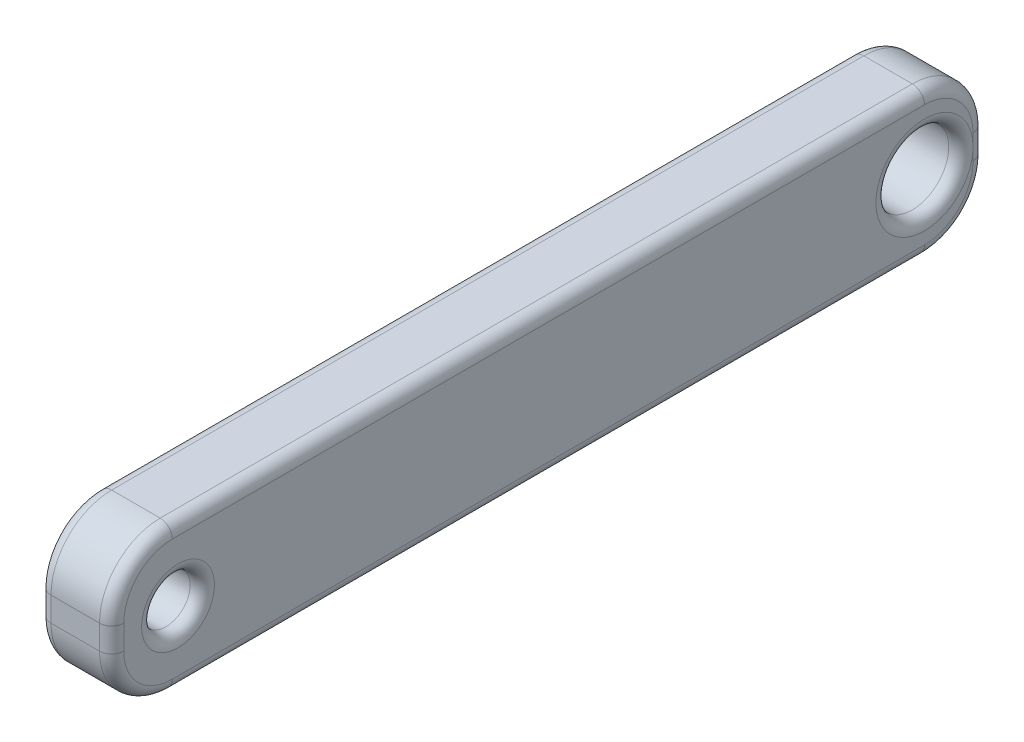
ISO-10303-21;
HEADER;
FILE_DESCRIPTION(('STEP AP214'),'2;1');
FILE_NAME('part.step','',(''),(''),'','','');
FILE_SCHEMA(('AUTOMOTIVE_DESIGN { 1 0 10303 214 1 1 1 1 }'));
ENDSEC;
DATA;
#1=APPLICATION_CONTEXT('core data for automotive mechanical design processes');
#2=APPLICATION_PROTOCOL_DEFINITION('international standard','automotive_design',2000,#1);
#3=PRODUCT_CONTEXT('',#1,'mechanical');
#4=PRODUCT('Part','Part','',(#3));
#5=PRODUCT_RELATED_PRODUCT_CATEGORY('part','',(#4));
#6=PRODUCT_DEFINITION_FORMATION('','',#4);
#7=PRODUCT_DEFINITION_CONTEXT('part definition',#1,'design');
#8=PRODUCT_DEFINITION('design','',#6,#7);
#9=PRODUCT_DEFINITION_SHAPE('','',#8);
#10=(LENGTH_UNIT() NAMED_UNIT(*) SI_UNIT(.MILLI.,.METRE.));
#11=(NAMED_UNIT(*) PLANE_ANGLE_UNIT() SI_UNIT($,.RADIAN.));
#12=(NAMED_UNIT(*) SI_UNIT($,.STERADIAN.) SOLID_ANGLE_UNIT());
#13=UNCERTAINTY_MEASURE_WITH_UNIT(LENGTH_MEASURE(1.E-05),#10,'distance_accuracy_value','');
#14=(GEOMETRIC_REPRESENTATION_CONTEXT(3) GLOBAL_UNCERTAINTY_ASSIGNED_CONTEXT((#13)) GLOBAL_UNIT_ASSIGNED_CONTEXT((#10,
#11,#12)) REPRESENTATION_CONTEXT('',''));
#15=CARTESIAN_POINT('',(0.,0.,0.));
#16=DIRECTION('',(0.,0.,1.));
#17=DIRECTION('',(1.,0.,0.));
#18=AXIS2_PLACEMENT_3D('',#15,#16,#17);
#19=CARTESIAN_POINT('',(3.,3.5,-33.5));
#20=DIRECTION('',(1.,0.,0.));
#21=DIRECTION('',(0.,0.,-1.));
#22=AXIS2_PLACEMENT_3D('',#19,#20,#21);
#23=PLANE('',#22);
#24=CARTESIAN_POINT('',(3.,3.,-2.73587532026645));
#25=DIRECTION('',(1.,0.,0.));
#26=DIRECTION('',(0.,0.,-1.));
#27=AXIS2_PLACEMENT_3D('',#24,#25,#26);
#28=CIRCLE('',#27,1.5);
#29=CARTESIAN_POINT('',(3.,3.,-4.23587532026645));
#30=VERTEX_POINT('',#29);
#31=EDGE_CURVE('E11',#30,#30,#28,.F.);
#32=ORIENTED_EDGE('',*,*,#31,.T.);
#33=EDGE_LOOP('',(#32));
#34=FACE_BOUND('',#33,.T.);
#35=CARTESIAN_POINT('',(3.,2.5,-33.5));
#36=DIRECTION('',(1.,0.,0.));
#37=DIRECTION('',(0.,0.,-1.));
#38=AXIS2_PLACEMENT_3D('',#35,#36,#37);
#39=CIRCLE('',#38,2.);
#40=CARTESIAN_POINT('',(3.,0.5,-33.5));
#41=VERTEX_POINT('',#40);
#42=CARTESIAN_POINT('',(3.,2.5,-35.5));
#43=VERTEX_POINT('',#42);
#44=EDGE_CURVE('E50',#41,#43,#39,.T.);
#45=ORIENTED_EDGE('',*,*,#44,.T.);
#46=DIRECTION('',(0.,1.,0.));
#47=VECTOR('',#46,1.);
#48=CARTESIAN_POINT('',(3.,3.5,-35.5));
#49=LINE('',#48,#47);
#50=CARTESIAN_POINT('',(3.,3.00000000000001,-35.5));
#51=VERTEX_POINT('',#50);
#52=EDGE_CURVE('E42',#43,#51,#49,.T.);
#53=ORIENTED_EDGE('',*,*,#52,.T.);
#54=CARTESIAN_POINT('',(3.,3.,-33.5));
#55=DIRECTION('',(1.,0.,0.));
#56=DIRECTION('',(0.,0.,-1.));
#57=AXIS2_PLACEMENT_3D('',#54,#55,#56);
#58=CIRCLE('',#57,2.);
#59=EDGE_CURVE('E248',#51,#51,#58,.F.);
#60=ORIENTED_EDGE('',*,*,#59,.T.);
#61=DIRECTION('',(0.,1.,0.));
#62=VECTOR('',#61,1.);
#63=CARTESIAN_POINT('',(3.,3.5,-35.5));
#64=LINE('',#63,#62);
#65=CARTESIAN_POINT('',(3.,3.5,-35.5));
#66=VERTEX_POINT('',#65);
#67=EDGE_CURVE('E251',#51,#66,#64,.T.);
#68=ORIENTED_EDGE('',*,*,#67,.T.);
#69=CARTESIAN_POINT('',(3.,3.5,-33.5));
#70=DIRECTION('',(1.,0.,0.));
#71=DIRECTION('',(0.,0.,-1.));
#72=AXIS2_PLACEMENT_3D('',#69,#70,#71);
#73=CIRCLE('',#72,2.);
#74=CARTESIAN_POINT('',(3.,5.5,-33.5));
#75=VERTEX_POINT('',#74);
#76=EDGE_CURVE('E253',#66,#75,#73,.T.);
#77=ORIENTED_EDGE('',*,*,#76,.T.);
#78=DIRECTION('',(0.,0.,1.));
#79=VECTOR('',#78,1.);
#80=CARTESIAN_POINT('',(3.,5.5,-2.50000000000002));
#81=LINE('',#80,#79);
#82=CARTESIAN_POINT('',(3.,5.5,-2.50000000000001));
#83=VERTEX_POINT('',#82);
#84=EDGE_CURVE('E255',#75,#83,#81,.T.);
#85=ORIENTED_EDGE('',*,*,#84,.T.);
#86=CARTESIAN_POINT('',(3.,3.5,-2.5));
#87=DIRECTION('',(1.,0.,0.));
#88=DIRECTION('',(0.,0.,-1.));
#89=AXIS2_PLACEMENT_3D('',#86,#87,#88);
#90=CIRCLE('',#89,2.);
#91=CARTESIAN_POINT('',(3.,3.49999999999998,-0.5));
#92=VERTEX_POINT('',#91);
#93=EDGE_CURVE('E257',#83,#92,#90,.T.);
#94=ORIENTED_EDGE('',*,*,#93,.T.);
#95=DIRECTION('',(0.,-1.,0.));
#96=VECTOR('',#95,1.);
#97=CARTESIAN_POINT('',(3.,2.50000000000002,-0.5));
#98=LINE('',#97,#96);
#99=CARTESIAN_POINT('',(3.,2.50000000000001,-0.5));
#100=VERTEX_POINT('',#99);
#101=EDGE_CURVE('E259',#92,#100,#98,.T.);
#102=ORIENTED_EDGE('',*,*,#101,.T.);
#103=CARTESIAN_POINT('',(3.,2.5,-2.5));
#104=DIRECTION('',(1.,0.,0.));
#105=DIRECTION('',(0.,0.,-1.));
#106=AXIS2_PLACEMENT_3D('',#103,#104,#105);
#107=CIRCLE('',#106,2.);
#108=CARTESIAN_POINT('',(3.,0.5,-2.50000000000002));
#109=VERTEX_POINT('',#108);
#110=EDGE_CURVE('E261',#100,#109,#107,.T.);
#111=ORIENTED_EDGE('',*,*,#110,.T.);
#112=DIRECTION('',(0.,0.,-1.));
#113=VECTOR('',#112,1.);
#114=CARTESIAN_POINT('',(3.,0.5,-33.5));
#115=LINE('',#114,#113);
#116=EDGE_CURVE('E55',#109,#41,#115,.T.);
#117=ORIENTED_EDGE('',*,*,#116,.T.);
#118=EDGE_LOOP('',(#45,#53,#60,#68,#77,#85,#94,#102,#111,#117));
#119=FACE_BOUND('',#118,.T.);
#120=ADVANCED_FACE('F33',(#34,#119),#23,.T.);
#121=CARTESIAN_POINT('',(0.,3.5,-33.5));
#122=DIRECTION('',(1.,0.,0.));
#123=DIRECTION('',(0.,0.,-1.));
#124=AXIS2_PLACEMENT_3D('',#121,#122,#123);
#125=PLANE('',#124);
#126=CARTESIAN_POINT('',(0.,3.,-2.73587532026645));
#127=DIRECTION('',(1.,0.,0.));
#128=DIRECTION('',(0.,0.,-1.));
#129=AXIS2_PLACEMENT_3D('',#126,#127,#128);
#130=CIRCLE('',#129,1.5);
#131=CARTESIAN_POINT('',(0.,3.,-4.23587532026645));
#132=VERTEX_POINT('',#131);
#133=EDGE_CURVE('E175',#132,#132,#130,.T.);
#134=ORIENTED_EDGE('',*,*,#133,.T.);
#135=EDGE_LOOP('',(#134));
#136=FACE_BOUND('',#135,.T.);
#137=CARTESIAN_POINT('',(0.,3.5,-33.5));
#138=DIRECTION('',(1.,0.,0.));
#139=DIRECTION('',(0.,0.,-1.));
#140=AXIS2_PLACEMENT_3D('',#137,#138,#139);
#141=CIRCLE('',#140,2.);
#142=CARTESIAN_POINT('',(0.,5.5,-33.5));
#143=VERTEX_POINT('',#142);
#144=CARTESIAN_POINT('',(0.,3.5,-35.5));
#145=VERTEX_POINT('',#144);
#146=EDGE_CURVE('E170',#143,#145,#141,.F.);
#147=ORIENTED_EDGE('',*,*,#146,.T.);
#148=DIRECTION('',(0.,1.,0.));
#149=VECTOR('',#148,1.);
#150=CARTESIAN_POINT('',(0.,3.50000000000001,-35.5));
#151=LINE('',#150,#149);
#152=CARTESIAN_POINT('',(0.,3.00000000000001,-35.5));
#153=VERTEX_POINT('',#152);
#154=EDGE_CURVE('E166',#145,#153,#151,.F.);
#155=ORIENTED_EDGE('',*,*,#154,.T.);
#156=CARTESIAN_POINT('',(0.,3.,-33.5));
#157=DIRECTION('',(1.,0.,0.));
#158=DIRECTION('',(0.,0.,-1.));
#159=AXIS2_PLACEMENT_3D('',#156,#157,#158);
#160=CIRCLE('',#159,2.);
#161=CARTESIAN_POINT('',(0.,3.,-31.5));
#162=VERTEX_POINT('',#161);
#163=EDGE_CURVE('E156',#153,#162,#160,.T.);
#164=ORIENTED_EDGE('',*,*,#163,.T.);
#165=CARTESIAN_POINT('',(0.,3.,-33.5));
#166=DIRECTION('',(1.,0.,0.));
#167=DIRECTION('',(0.,0.,-1.));
#168=AXIS2_PLACEMENT_3D('',#165,#166,#167);
#169=CIRCLE('',#168,2.);
#170=EDGE_CURVE('E161',#162,#153,#169,.T.);
#171=ORIENTED_EDGE('',*,*,#170,.T.);
#172=DIRECTION('',(0.,1.,0.));
#173=VECTOR('',#172,1.);
#174=CARTESIAN_POINT('',(0.,3.50000000000001,-35.5));
#175=LINE('',#174,#173);
#176=CARTESIAN_POINT('',(0.,2.5,-35.5));
#177=VERTEX_POINT('',#176);
#178=EDGE_CURVE('E177',#153,#177,#175,.F.);
#179=ORIENTED_EDGE('',*,*,#178,.T.);
#180=CARTESIAN_POINT('',(0.,2.5,-33.5));
#181=DIRECTION('',(1.,0.,0.));
#182=DIRECTION('',(0.,0.,-1.));
#183=AXIS2_PLACEMENT_3D('',#180,#181,#182);
#184=CIRCLE('',#183,2.);
#185=CARTESIAN_POINT('',(0.,0.499999999999999,-33.5));
#186=VERTEX_POINT('',#185);
#187=EDGE_CURVE('E185',#177,#186,#184,.F.);
#188=ORIENTED_EDGE('',*,*,#187,.T.);
#189=DIRECTION('',(0.,0.,-1.));
#190=VECTOR('',#189,1.);
#191=CARTESIAN_POINT('',(0.,0.5,-33.5));
#192=LINE('',#191,#190);
#193=CARTESIAN_POINT('',(0.,0.5,-2.50000000000001));
#194=VERTEX_POINT('',#193);
#195=EDGE_CURVE('E187',#186,#194,#192,.F.);
#196=ORIENTED_EDGE('',*,*,#195,.T.);
#197=CARTESIAN_POINT('',(0.,2.5,-2.5));
#198=DIRECTION('',(1.,0.,0.));
#199=DIRECTION('',(0.,0.,-1.));
#200=AXIS2_PLACEMENT_3D('',#197,#198,#199);
#201=CIRCLE('',#200,2.);
#202=CARTESIAN_POINT('',(0.,2.50000000000002,-0.5));
#203=VERTEX_POINT('',#202);
#204=EDGE_CURVE('E191',#194,#203,#201,.F.);
#205=ORIENTED_EDGE('',*,*,#204,.T.);
#206=DIRECTION('',(0.,-1.,0.));
#207=VECTOR('',#206,1.);
#208=CARTESIAN_POINT('',(0.,3.5,-0.5));
#209=LINE('',#208,#207);
#210=CARTESIAN_POINT('',(0.,3.49999999999999,-0.5));
#211=VERTEX_POINT('',#210);
#212=EDGE_CURVE('E193',#203,#211,#209,.F.);
#213=ORIENTED_EDGE('',*,*,#212,.T.);
#214=CARTESIAN_POINT('',(0.,3.5,-2.5));
#215=DIRECTION('',(1.,0.,0.));
#216=DIRECTION('',(0.,0.,-1.));
#217=AXIS2_PLACEMENT_3D('',#214,#215,#216);
#218=CIRCLE('',#217,2.);
#219=CARTESIAN_POINT('',(0.,5.5,-2.50000000000002));
#220=VERTEX_POINT('',#219);
#221=EDGE_CURVE('E195',#211,#220,#218,.F.);
#222=ORIENTED_EDGE('',*,*,#221,.T.);
#223=DIRECTION('',(0.,0.,1.));
#224=VECTOR('',#223,1.);
#225=CARTESIAN_POINT('',(0.,5.5,-33.5));
#226=LINE('',#225,#224);
#227=EDGE_CURVE('E197',#220,#143,#226,.F.);
#228=ORIENTED_EDGE('',*,*,#227,.T.);
#229=EDGE_LOOP('',(#147,#155,#164,#171,#179,#188,#196,#205,#213,#222,#228));
#230=FACE_BOUND('',#229,.T.);
#231=ADVANCED_FACE('F167',(#136,#230),#125,.F.);
#232=CARTESIAN_POINT('',(3.,3.5,-33.5));
#233=DIRECTION('',(-1.,0.,0.));
#234=DIRECTION('',(0.,0.,1.));
#235=AXIS2_PLACEMENT_3D('',#232,#233,#234);
#236=CYLINDRICAL_SURFACE('',#235,2.5);
#237=DIRECTION('',(-1.,0.,0.));
#238=VECTOR('',#237,1.);
#239=CARTESIAN_POINT('',(3.,3.5,-36.));
#240=LINE('',#239,#238);
#241=CARTESIAN_POINT('',(2.5,3.5,-36.));
#242=VERTEX_POINT('',#241);
#243=CARTESIAN_POINT('',(0.5,3.5,-36.));
#244=VERTEX_POINT('',#243);
#245=EDGE_CURVE('E285',#242,#244,#240,.T.);
#246=ORIENTED_EDGE('',*,*,#245,.T.);
#247=CARTESIAN_POINT('',(0.5,3.5,-33.5));
#248=DIRECTION('',(1.,0.,0.));
#249=DIRECTION('',(0.,0.,-1.));
#250=AXIS2_PLACEMENT_3D('',#247,#248,#249);
#251=CIRCLE('',#250,2.5);
#252=CARTESIAN_POINT('',(0.5,6.,-33.5));
#253=VERTEX_POINT('',#252);
#254=EDGE_CURVE('E240',#244,#253,#251,.T.);
#255=ORIENTED_EDGE('',*,*,#254,.T.);
#256=DIRECTION('',(-1.,0.,0.));
#257=VECTOR('',#256,1.);
#258=CARTESIAN_POINT('',(3.,6.,-33.5));
#259=LINE('',#258,#257);
#260=CARTESIAN_POINT('',(2.5,6.,-33.5));
#261=VERTEX_POINT('',#260);
#262=EDGE_CURVE('E163',#261,#253,#259,.T.);
#263=ORIENTED_EDGE('',*,*,#262,.F.);
#264=CARTESIAN_POINT('',(2.5,3.5,-33.5));
#265=DIRECTION('',(1.,0.,0.));
#266=DIRECTION('',(0.,0.,-1.));
#267=AXIS2_PLACEMENT_3D('',#264,#265,#266);
#268=CIRCLE('',#267,2.5);
#269=EDGE_CURVE('E238',#261,#242,#268,.F.);
#270=ORIENTED_EDGE('',*,*,#269,.T.);
#271=EDGE_LOOP('',(#246,#255,#263,#270));
#272=FACE_BOUND('',#271,.T.);
#273=ADVANCED_FACE('F396',(#272),#236,.T.);
#274=CARTESIAN_POINT('',(3.,6.,-2.50000000000002));
#275=DIRECTION('',(0.,-1.,0.));
#276=DIRECTION('',(0.,0.,-1.));
#277=AXIS2_PLACEMENT_3D('',#274,#275,#276);
#278=PLANE('',#277);
#279=ORIENTED_EDGE('',*,*,#262,.T.);
#280=DIRECTION('',(0.,0.,1.));
#281=VECTOR('',#280,1.);
#282=CARTESIAN_POINT('',(0.5,6.,-2.50000000000002));
#283=LINE('',#282,#281);
#284=CARTESIAN_POINT('',(0.5,6.,-2.50000000000002));
#285=VERTEX_POINT('',#284);
#286=EDGE_CURVE('E210',#253,#285,#283,.T.);
#287=ORIENTED_EDGE('',*,*,#286,.T.);
#288=DIRECTION('',(-1.,0.,0.));
#289=VECTOR('',#288,1.);
#290=CARTESIAN_POINT('',(3.,6.,-2.50000000000002));
#291=LINE('',#290,#289);
#292=CARTESIAN_POINT('',(2.5,6.,-2.50000000000002));
#293=VERTEX_POINT('',#292);
#294=EDGE_CURVE('E333',#293,#285,#291,.T.);
#295=ORIENTED_EDGE('',*,*,#294,.F.);
#296=DIRECTION('',(0.,0.,1.));
#297=VECTOR('',#296,1.);
#298=CARTESIAN_POINT('',(2.5,6.,-33.5));
#299=LINE('',#298,#297);
#300=EDGE_CURVE('E208',#293,#261,#299,.F.);
#301=ORIENTED_EDGE('',*,*,#300,.T.);
#302=EDGE_LOOP('',(#279,#287,#295,#301));
#303=FACE_BOUND('',#302,.T.);
#304=ADVANCED_FACE('F344',(#303),#278,.F.);
#305=CARTESIAN_POINT('',(3.,3.5,-2.5));
#306=DIRECTION('',(-1.,0.,0.));
#307=DIRECTION('',(0.,0.,1.));
#308=AXIS2_PLACEMENT_3D('',#305,#306,#307);
#309=CYLINDRICAL_SURFACE('',#308,2.5);
#310=ORIENTED_EDGE('',*,*,#294,.T.);
#311=CARTESIAN_POINT('',(0.5,3.5,-2.5));
#312=DIRECTION('',(1.,0.,0.));
#313=DIRECTION('',(0.,0.,-1.));
#314=AXIS2_PLACEMENT_3D('',#311,#312,#313);
#315=CIRCLE('',#314,2.5);
#316=CARTESIAN_POINT('',(0.5,3.49999999999998,0.));
#317=VERTEX_POINT('',#316);
#318=EDGE_CURVE('E215',#285,#317,#315,.T.);
#319=ORIENTED_EDGE('',*,*,#318,.T.);
#320=DIRECTION('',(-1.,0.,0.));
#321=VECTOR('',#320,1.);
#322=CARTESIAN_POINT('',(3.,3.49999999999998,0.));
#323=LINE('',#322,#321);
#324=CARTESIAN_POINT('',(2.5,3.49999999999998,0.));
#325=VERTEX_POINT('',#324);
#326=EDGE_CURVE('E324',#325,#317,#323,.T.);
#327=ORIENTED_EDGE('',*,*,#326,.F.);
#328=CARTESIAN_POINT('',(2.5,3.5,-2.5));
#329=DIRECTION('',(1.,0.,0.));
#330=DIRECTION('',(0.,0.,-1.));
#331=AXIS2_PLACEMENT_3D('',#328,#329,#330);
#332=CIRCLE('',#331,2.5);
#333=EDGE_CURVE('E213',#325,#293,#332,.F.);
#334=ORIENTED_EDGE('',*,*,#333,.T.);
#335=EDGE_LOOP('',(#310,#319,#327,#334));
#336=FACE_BOUND('',#335,.T.);
#337=ADVANCED_FACE('F330',(#336),#309,.T.);
#338=CARTESIAN_POINT('',(3.,2.50000000000002,0.));
#339=DIRECTION('',(0.,0.,-1.));
#340=DIRECTION('',(-1.,0.,0.));
#341=AXIS2_PLACEMENT_3D('',#338,#339,#340);
#342=PLANE('',#341);
#343=ORIENTED_EDGE('',*,*,#326,.T.);
#344=DIRECTION('',(0.,-1.,0.));
#345=VECTOR('',#344,1.);
#346=CARTESIAN_POINT('',(0.5,2.50000000000002,0.));
#347=LINE('',#346,#345);
#348=CARTESIAN_POINT('',(0.5,2.50000000000002,0.));
#349=VERTEX_POINT('',#348);
#350=EDGE_CURVE('E219',#317,#349,#347,.T.);
#351=ORIENTED_EDGE('',*,*,#350,.T.);
#352=DIRECTION('',(-1.,0.,0.));
#353=VECTOR('',#352,1.);
#354=CARTESIAN_POINT('',(3.,2.50000000000002,0.));
#355=LINE('',#354,#353);
#356=CARTESIAN_POINT('',(2.5,2.50000000000002,0.));
#357=VERTEX_POINT('',#356);
#358=EDGE_CURVE('E327',#357,#349,#355,.T.);
#359=ORIENTED_EDGE('',*,*,#358,.F.);
#360=DIRECTION('',(0.,-1.,0.));
#361=VECTOR('',#360,1.);
#362=CARTESIAN_POINT('',(2.5,3.49999999999998,0.));
#363=LINE('',#362,#361);
#364=EDGE_CURVE('E217',#357,#325,#363,.F.);
#365=ORIENTED_EDGE('',*,*,#364,.T.);
#366=EDGE_LOOP('',(#343,#351,#359,#365));
#367=FACE_BOUND('',#366,.T.);
#368=ADVANCED_FACE('F323',(#367),#342,.F.);
#369=CARTESIAN_POINT('',(3.,2.5,-2.5));
#370=DIRECTION('',(-1.,0.,0.));
#371=DIRECTION('',(0.,0.,1.));
#372=AXIS2_PLACEMENT_3D('',#369,#370,#371);
#373=CYLINDRICAL_SURFACE('',#372,2.5);
#374=ORIENTED_EDGE('',*,*,#358,.T.);
#375=CARTESIAN_POINT('',(0.5,2.5,-2.5));
#376=DIRECTION('',(1.,0.,0.));
#377=DIRECTION('',(0.,0.,-1.));
#378=AXIS2_PLACEMENT_3D('',#375,#376,#377);
#379=CIRCLE('',#378,2.5);
#380=CARTESIAN_POINT('',(0.5,0.,-2.50000000000002));
#381=VERTEX_POINT('',#380);
#382=EDGE_CURVE('E223',#349,#381,#379,.T.);
#383=ORIENTED_EDGE('',*,*,#382,.T.);
#384=DIRECTION('',(-1.,0.,0.));
#385=VECTOR('',#384,1.);
#386=CARTESIAN_POINT('',(3.,0.,-2.50000000000002));
#387=LINE('',#386,#385);
#388=CARTESIAN_POINT('',(2.5,0.,-2.50000000000002));
#389=VERTEX_POINT('',#388);
#390=EDGE_CURVE('E336',#389,#381,#387,.T.);
#391=ORIENTED_EDGE('',*,*,#390,.F.);
#392=CARTESIAN_POINT('',(2.5,2.5,-2.5));
#393=DIRECTION('',(1.,0.,0.));
#394=DIRECTION('',(0.,0.,-1.));
#395=AXIS2_PLACEMENT_3D('',#392,#393,#394);
#396=CIRCLE('',#395,2.5);
#397=EDGE_CURVE('E221',#389,#357,#396,.F.);
#398=ORIENTED_EDGE('',*,*,#397,.T.);
#399=EDGE_LOOP('',(#374,#383,#391,#398));
#400=FACE_BOUND('',#399,.T.);
#401=ADVANCED_FACE('F366',(#400),#373,.T.);
#402=CARTESIAN_POINT('',(3.,0.,-2.50000000000002));
#403=DIRECTION('',(0.,1.,0.));
#404=DIRECTION('',(0.,0.,1.));
#405=AXIS2_PLACEMENT_3D('',#402,#403,#404);
#406=PLANE('',#405);
#407=ORIENTED_EDGE('',*,*,#390,.T.);
#408=DIRECTION('',(0.,0.,-1.));
#409=VECTOR('',#408,1.);
#410=CARTESIAN_POINT('',(0.5,0.,-2.50000000000002));
#411=LINE('',#410,#409);
#412=CARTESIAN_POINT('',(0.5,0.,-33.5));
#413=VERTEX_POINT('',#412);
#414=EDGE_CURVE('E227',#381,#413,#411,.T.);
#415=ORIENTED_EDGE('',*,*,#414,.T.);
#416=DIRECTION('',(-1.,0.,0.));
#417=VECTOR('',#416,1.);
#418=CARTESIAN_POINT('',(3.,0.,-33.5));
#419=LINE('',#418,#417);
#420=CARTESIAN_POINT('',(2.5,0.,-33.5));
#421=VERTEX_POINT('',#420);
#422=EDGE_CURVE('E383',#421,#413,#419,.T.);
#423=ORIENTED_EDGE('',*,*,#422,.F.);
#424=DIRECTION('',(0.,0.,-1.));
#425=VECTOR('',#424,1.);
#426=CARTESIAN_POINT('',(2.5,0.,-2.50000000000002));
#427=LINE('',#426,#425);
#428=EDGE_CURVE('E225',#421,#389,#427,.F.);
#429=ORIENTED_EDGE('',*,*,#428,.T.);
#430=EDGE_LOOP('',(#407,#415,#423,#429));
#431=FACE_BOUND('',#430,.T.);
#432=ADVANCED_FACE('F382',(#431),#406,.F.);
#433=CARTESIAN_POINT('',(3.,2.5,-33.5));
#434=DIRECTION('',(-1.,0.,0.));
#435=DIRECTION('',(0.,0.,1.));
#436=AXIS2_PLACEMENT_3D('',#433,#434,#435);
#437=CYLINDRICAL_SURFACE('',#436,2.5);
#438=ORIENTED_EDGE('',*,*,#422,.T.);
#439=CARTESIAN_POINT('',(0.5,2.5,-33.5));
#440=DIRECTION('',(1.,0.,0.));
#441=DIRECTION('',(0.,0.,-1.));
#442=AXIS2_PLACEMENT_3D('',#439,#440,#441);
#443=CIRCLE('',#442,2.5);
#444=CARTESIAN_POINT('',(0.5,2.5,-36.));
#445=VERTEX_POINT('',#444);
#446=EDGE_CURVE('E231',#413,#445,#443,.T.);
#447=ORIENTED_EDGE('',*,*,#446,.T.);
#448=DIRECTION('',(-1.,0.,0.));
#449=VECTOR('',#448,1.);
#450=CARTESIAN_POINT('',(3.,2.5,-36.));
#451=LINE('',#450,#449);
#452=CARTESIAN_POINT('',(2.5,2.5,-36.));
#453=VERTEX_POINT('',#452);
#454=EDGE_CURVE('E390',#453,#445,#451,.T.);
#455=ORIENTED_EDGE('',*,*,#454,.F.);
#456=CARTESIAN_POINT('',(2.5,2.5,-33.5));
#457=DIRECTION('',(1.,0.,0.));
#458=DIRECTION('',(0.,0.,-1.));
#459=AXIS2_PLACEMENT_3D('',#456,#457,#458);
#460=CIRCLE('',#459,2.5);
#461=EDGE_CURVE('E229',#453,#421,#460,.F.);
#462=ORIENTED_EDGE('',*,*,#461,.T.);
#463=EDGE_LOOP('',(#438,#447,#455,#462));
#464=FACE_BOUND('',#463,.T.);
#465=ADVANCED_FACE('F386',(#464),#437,.T.);
#466=CARTESIAN_POINT('',(3.,2.5,-36.));
#467=DIRECTION('',(0.,0.,1.));
#468=DIRECTION('',(0.,-1.,0.));
#469=AXIS2_PLACEMENT_3D('',#466,#467,#468);
#470=PLANE('',#469);
#471=ORIENTED_EDGE('',*,*,#454,.T.);
#472=DIRECTION('',(0.,1.,0.));
#473=VECTOR('',#472,1.);
#474=CARTESIAN_POINT('',(0.5,2.5,-36.));
#475=LINE('',#474,#473);
#476=EDGE_CURVE('E236',#445,#244,#475,.T.);
#477=ORIENTED_EDGE('',*,*,#476,.T.);
#478=ORIENTED_EDGE('',*,*,#245,.F.);
#479=DIRECTION('',(0.,1.,0.));
#480=VECTOR('',#479,1.);
#481=CARTESIAN_POINT('',(2.5,2.5,-36.));
#482=LINE('',#481,#480);
#483=EDGE_CURVE('E233',#242,#453,#482,.F.);
#484=ORIENTED_EDGE('',*,*,#483,.T.);
#485=EDGE_LOOP('',(#471,#477,#478,#484));
#486=FACE_BOUND('',#485,.T.);
#487=ADVANCED_FACE('F400',(#486),#470,.F.);
#488=CARTESIAN_POINT('',(3.,3.,-2.73587532026645));
#489=DIRECTION('',(-1.,0.,0.));
#490=DIRECTION('',(0.,0.,1.));
#491=AXIS2_PLACEMENT_3D('',#488,#489,#490);
#492=CYLINDRICAL_SURFACE('',#491,1.);
#493=CARTESIAN_POINT('',(0.5,3.,-2.73587532026645));
#494=DIRECTION('',(1.,0.,0.));
#495=DIRECTION('',(0.,0.,-1.));
#496=AXIS2_PLACEMENT_3D('',#493,#494,#495);
#497=CIRCLE('',#496,1.);
#498=CARTESIAN_POINT('',(0.5,3.,-3.73587532026645));
#499=VERTEX_POINT('',#498);
#500=EDGE_CURVE('E205',#499,#499,#497,.F.);
#501=ORIENTED_EDGE('',*,*,#500,.T.);
#502=EDGE_LOOP('',(#501));
#503=FACE_BOUND('',#502,.T.);
#504=CARTESIAN_POINT('',(2.5,3.,-2.73587532026645));
#505=DIRECTION('',(1.,0.,0.));
#506=DIRECTION('',(0.,0.,-1.));
#507=AXIS2_PLACEMENT_3D('',#504,#505,#506);
#508=CIRCLE('',#507,1.);
#509=CARTESIAN_POINT('',(2.5,3.,-3.73587532026645));
#510=VERTEX_POINT('',#509);
#511=EDGE_CURVE('E202',#510,#510,#508,.T.);
#512=ORIENTED_EDGE('',*,*,#511,.T.);
#513=EDGE_LOOP('',(#512));
#514=FACE_BOUND('',#513,.T.);
#515=ADVANCED_FACE('F421',(#503,#514),#492,.F.);
#516=CARTESIAN_POINT('',(10.,3.,-33.5));
#517=DIRECTION('',(-1.,0.,0.));
#518=DIRECTION('',(0.,0.,1.));
#519=AXIS2_PLACEMENT_3D('',#516,#517,#518);
#520=CYLINDRICAL_SURFACE('',#519,1.5);
#521=CARTESIAN_POINT('',(0.5,3.,-33.5));
#522=DIRECTION('',(1.,0.,0.));
#523=DIRECTION('',(0.,0.,-1.));
#524=AXIS2_PLACEMENT_3D('',#521,#522,#523);
#525=CIRCLE('',#524,1.5);
#526=CARTESIAN_POINT('',(0.5,3.,-35.));
#527=VERTEX_POINT('',#526);
#528=EDGE_CURVE('E245',#527,#527,#525,.F.);
#529=ORIENTED_EDGE('',*,*,#528,.T.);
#530=EDGE_LOOP('',(#529));
#531=FACE_BOUND('',#530,.T.);
#532=CARTESIAN_POINT('',(2.5,3.,-33.5));
#533=DIRECTION('',(1.,0.,0.));
#534=DIRECTION('',(0.,0.,-1.));
#535=AXIS2_PLACEMENT_3D('',#532,#533,#534);
#536=CIRCLE('',#535,1.5);
#537=CARTESIAN_POINT('',(2.5,3.,-35.));
#538=VERTEX_POINT('',#537);
#539=EDGE_CURVE('E242',#538,#538,#536,.T.);
#540=ORIENTED_EDGE('',*,*,#539,.T.);
#541=EDGE_LOOP('',(#540));
#542=FACE_BOUND('',#541,.T.);
#543=ADVANCED_FACE('F442',(#531,#542),#520,.F.);
#544=CARTESIAN_POINT('',(0.5,3.,-2.73587532026645));
#545=DIRECTION('',(1.,0.,0.));
#546=DIRECTION('',(0.,0.,-1.));
#547=AXIS2_PLACEMENT_3D('',#544,#545,#546);
#548=TOROIDAL_SURFACE('',#547,1.5,0.5);
#549=ORIENTED_EDGE('',*,*,#500,.F.);
#550=EDGE_LOOP('',(#549));
#551=FACE_BOUND('',#550,.T.);
#552=ORIENTED_EDGE('',*,*,#133,.F.);
#553=EDGE_LOOP('',(#552));
#554=FACE_BOUND('',#553,.T.);
#555=ADVANCED_FACE('F410',(#551,#554),#548,.T.);
#556=CARTESIAN_POINT('',(0.5,0.5,-2.50000000000002));
#557=DIRECTION('',(0.,0.,-1.));
#558=DIRECTION('',(-1.,0.,0.));
#559=AXIS2_PLACEMENT_3D('',#556,#557,#558);
#560=CYLINDRICAL_SURFACE('',#559,0.5);
#561=CARTESIAN_POINT('',(0.5,0.5,-2.50000000000001));
#562=DIRECTION('',(0.,0.,1.));
#563=DIRECTION('',(0.,-1.,0.));
#564=AXIS2_PLACEMENT_3D('',#561,#562,#563);
#565=CIRCLE('',#564,0.5);
#566=EDGE_CURVE('E279',#194,#381,#565,.T.);
#567=ORIENTED_EDGE('',*,*,#566,.F.);
#568=ORIENTED_EDGE('',*,*,#195,.F.);
#569=CARTESIAN_POINT('',(0.5,0.5,-33.5));
#570=DIRECTION('',(0.,0.,-1.));
#571=DIRECTION('',(-1.,0.,0.));
#572=AXIS2_PLACEMENT_3D('',#569,#570,#571);
#573=CIRCLE('',#572,0.5);
#574=EDGE_CURVE('E282',#413,#186,#573,.T.);
#575=ORIENTED_EDGE('',*,*,#574,.F.);
#576=ORIENTED_EDGE('',*,*,#414,.F.);
#577=EDGE_LOOP('',(#567,#568,#575,#576));
#578=FACE_BOUND('',#577,.T.);
#579=ADVANCED_FACE('F376',(#578),#560,.T.);
#580=CARTESIAN_POINT('',(0.5,2.5,-33.5));
#581=DIRECTION('',(1.,0.,0.));
#582=DIRECTION('',(0.,0.,-1.));
#583=AXIS2_PLACEMENT_3D('',#580,#581,#582);
#584=TOROIDAL_SURFACE('',#583,2.,0.5);
#585=ORIENTED_EDGE('',*,*,#574,.T.);
#586=ORIENTED_EDGE('',*,*,#187,.F.);
#587=CARTESIAN_POINT('',(0.5,2.5,-35.5));
#588=DIRECTION('',(0.,1.,0.));
#589=DIRECTION('',(0.,0.,1.));
#590=AXIS2_PLACEMENT_3D('',#587,#588,#589);
#591=CIRCLE('',#590,0.5);
#592=EDGE_CURVE('E184',#445,#177,#591,.T.);
#593=ORIENTED_EDGE('',*,*,#592,.F.);
#594=ORIENTED_EDGE('',*,*,#446,.F.);
#595=EDGE_LOOP('',(#585,#586,#593,#594));
#596=FACE_BOUND('',#595,.T.);
#597=ADVANCED_FACE('F402',(#596),#584,.T.);
#598=CARTESIAN_POINT('',(0.5,2.5,-2.5));
#599=DIRECTION('',(1.,0.,0.));
#600=DIRECTION('',(0.,0.,-1.));
#601=AXIS2_PLACEMENT_3D('',#598,#599,#600);
#602=TOROIDAL_SURFACE('',#601,2.,0.5);
#603=ORIENTED_EDGE('',*,*,#566,.T.);
#604=ORIENTED_EDGE('',*,*,#382,.F.);
#605=CARTESIAN_POINT('',(0.5,2.50000000000002,-0.5));
#606=DIRECTION('',(0.,1.,0.));
#607=DIRECTION('',(0.,0.,1.));
#608=AXIS2_PLACEMENT_3D('',#605,#606,#607);
#609=CIRCLE('',#608,0.5);
#610=EDGE_CURVE('E275',#203,#349,#609,.T.);
#611=ORIENTED_EDGE('',*,*,#610,.F.);
#612=ORIENTED_EDGE('',*,*,#204,.F.);
#613=EDGE_LOOP('',(#603,#604,#611,#612));
#614=FACE_BOUND('',#613,.T.);
#615=ADVANCED_FACE('F370',(#614),#602,.T.);
#616=CARTESIAN_POINT('',(0.5,2.5,-35.5));
#617=DIRECTION('',(0.,1.,0.));
#618=DIRECTION('',(0.,0.,1.));
#619=AXIS2_PLACEMENT_3D('',#616,#617,#618);
#620=CYLINDRICAL_SURFACE('',#619,0.5);
#621=ORIENTED_EDGE('',*,*,#178,.F.);
#622=ORIENTED_EDGE('',*,*,#154,.F.);
#623=CARTESIAN_POINT('',(0.5,3.5,-35.5));
#624=DIRECTION('',(0.,1.,0.));
#625=DIRECTION('',(0.,0.,1.));
#626=AXIS2_PLACEMENT_3D('',#623,#624,#625);
#627=CIRCLE('',#626,0.5);
#628=EDGE_CURVE('E273',#244,#145,#627,.T.);
#629=ORIENTED_EDGE('',*,*,#628,.F.);
#630=ORIENTED_EDGE('',*,*,#476,.F.);
#631=ORIENTED_EDGE('',*,*,#592,.T.);
#632=EDGE_LOOP('',(#621,#622,#629,#630,#631));
#633=FACE_BOUND('',#632,.T.);
#634=ADVANCED_FACE('F181',(#633),#620,.T.);
#635=CARTESIAN_POINT('',(0.5,2.50000000000002,-0.5));
#636=DIRECTION('',(0.,-1.,0.));
#637=DIRECTION('',(0.,0.,-1.));
#638=AXIS2_PLACEMENT_3D('',#635,#636,#637);
#639=CYLINDRICAL_SURFACE('',#638,0.5);
#640=ORIENTED_EDGE('',*,*,#610,.T.);
#641=ORIENTED_EDGE('',*,*,#350,.F.);
#642=CARTESIAN_POINT('',(0.5,3.49999999999999,-0.5));
#643=DIRECTION('',(0.,1.,0.));
#644=DIRECTION('',(0.,0.,1.));
#645=AXIS2_PLACEMENT_3D('',#642,#643,#644);
#646=CIRCLE('',#645,0.5);
#647=EDGE_CURVE('E270',#211,#317,#646,.T.);
#648=ORIENTED_EDGE('',*,*,#647,.F.);
#649=ORIENTED_EDGE('',*,*,#212,.F.);
#650=EDGE_LOOP('',(#640,#641,#648,#649));
#651=FACE_BOUND('',#650,.T.);
#652=ADVANCED_FACE('F362',(#651),#639,.T.);
#653=CARTESIAN_POINT('',(0.5,3.5,-33.5));
#654=DIRECTION('',(1.,0.,0.));
#655=DIRECTION('',(0.,0.,-1.));
#656=AXIS2_PLACEMENT_3D('',#653,#654,#655);
#657=TOROIDAL_SURFACE('',#656,2.,0.5);
#658=ORIENTED_EDGE('',*,*,#628,.T.);
#659=ORIENTED_EDGE('',*,*,#146,.F.);
#660=CARTESIAN_POINT('',(0.5,5.5,-33.5));
#661=DIRECTION('',(0.,0.,1.));
#662=DIRECTION('',(1.,0.,0.));
#663=AXIS2_PLACEMENT_3D('',#660,#661,#662);
#664=CIRCLE('',#663,0.5);
#665=EDGE_CURVE('E268',#253,#143,#664,.T.);
#666=ORIENTED_EDGE('',*,*,#665,.F.);
#667=ORIENTED_EDGE('',*,*,#254,.F.);
#668=EDGE_LOOP('',(#658,#659,#666,#667));
#669=FACE_BOUND('',#668,.T.);
#670=ADVANCED_FACE('F351',(#669),#657,.T.);
#671=CARTESIAN_POINT('',(0.5,3.5,-2.5));
#672=DIRECTION('',(1.,0.,0.));
#673=DIRECTION('',(0.,0.,-1.));
#674=AXIS2_PLACEMENT_3D('',#671,#672,#673);
#675=TOROIDAL_SURFACE('',#674,2.,0.5);
#676=ORIENTED_EDGE('',*,*,#647,.T.);
#677=ORIENTED_EDGE('',*,*,#318,.F.);
#678=CARTESIAN_POINT('',(0.5,5.5,-2.50000000000002));
#679=DIRECTION('',(0.,0.,-1.));
#680=DIRECTION('',(-1.,0.,0.));
#681=AXIS2_PLACEMENT_3D('',#678,#679,#680);
#682=CIRCLE('',#681,0.5);
#683=EDGE_CURVE('E266',#220,#285,#682,.T.);
#684=ORIENTED_EDGE('',*,*,#683,.F.);
#685=ORIENTED_EDGE('',*,*,#221,.F.);
#686=EDGE_LOOP('',(#676,#677,#684,#685));
#687=FACE_BOUND('',#686,.T.);
#688=ADVANCED_FACE('F358',(#687),#675,.T.);
#689=CARTESIAN_POINT('',(0.5,5.5,-2.50000000000002));
#690=DIRECTION('',(0.,0.,1.));
#691=DIRECTION('',(1.,0.,0.));
#692=AXIS2_PLACEMENT_3D('',#689,#690,#691);
#693=CYLINDRICAL_SURFACE('',#692,0.5);
#694=ORIENTED_EDGE('',*,*,#665,.T.);
#695=ORIENTED_EDGE('',*,*,#227,.F.);
#696=ORIENTED_EDGE('',*,*,#683,.T.);
#697=ORIENTED_EDGE('',*,*,#286,.F.);
#698=EDGE_LOOP('',(#694,#695,#696,#697));
#699=FACE_BOUND('',#698,.T.);
#700=ADVANCED_FACE('F354',(#699),#693,.T.);
#701=CARTESIAN_POINT('',(0.5,3.,-33.5));
#702=DIRECTION('',(1.,0.,0.));
#703=DIRECTION('',(0.,0.,-1.));
#704=AXIS2_PLACEMENT_3D('',#701,#702,#703);
#705=TOROIDAL_SURFACE('',#704,2.,0.5);
#706=ORIENTED_EDGE('',*,*,#163,.F.);
#707=ORIENTED_EDGE('',*,*,#170,.F.);
#708=EDGE_LOOP('',(#706,#707));
#709=FACE_BOUND('',#708,.T.);
#710=ORIENTED_EDGE('',*,*,#528,.F.);
#711=EDGE_LOOP('',(#710));
#712=FACE_BOUND('',#711,.T.);
#713=ADVANCED_FACE('F158',(#709,#712),#705,.T.);
#714=CARTESIAN_POINT('',(2.5,3.,-2.73587532026645));
#715=DIRECTION('',(1.,0.,0.));
#716=DIRECTION('',(0.,0.,-1.));
#717=AXIS2_PLACEMENT_3D('',#714,#715,#716);
#718=TOROIDAL_SURFACE('',#717,1.5,0.5);
#719=ORIENTED_EDGE('',*,*,#31,.F.);
#720=EDGE_LOOP('',(#719));
#721=FACE_BOUND('',#720,.T.);
#722=ORIENTED_EDGE('',*,*,#511,.F.);
#723=EDGE_LOOP('',(#722));
#724=FACE_BOUND('',#723,.T.);
#725=ADVANCED_FACE('F479',(#721,#724),#718,.T.);
#726=CARTESIAN_POINT('',(2.5,3.5,-0.5));
#727=DIRECTION('',(0.,1.,0.));
#728=DIRECTION('',(0.,0.,1.));
#729=AXIS2_PLACEMENT_3D('',#726,#727,#728);
#730=CYLINDRICAL_SURFACE('',#729,0.5);
#731=CARTESIAN_POINT('',(2.5,3.49999999999998,-0.5));
#732=DIRECTION('',(0.,1.,0.));
#733=DIRECTION('',(0.,0.,1.));
#734=AXIS2_PLACEMENT_3D('',#731,#732,#733);
#735=CIRCLE('',#734,0.5);
#736=EDGE_CURVE('E302',#325,#92,#735,.T.);
#737=ORIENTED_EDGE('',*,*,#736,.F.);
#738=ORIENTED_EDGE('',*,*,#364,.F.);
#739=CARTESIAN_POINT('',(2.5,2.50000000000001,-0.5));
#740=DIRECTION('',(0.,-1.,0.));
#741=DIRECTION('',(0.,0.,-1.));
#742=AXIS2_PLACEMENT_3D('',#739,#740,#741);
#743=CIRCLE('',#742,0.5);
#744=EDGE_CURVE('E37',#100,#357,#743,.T.);
#745=ORIENTED_EDGE('',*,*,#744,.F.);
#746=ORIENTED_EDGE('',*,*,#101,.F.);
#747=EDGE_LOOP('',(#737,#738,#745,#746));
#748=FACE_BOUND('',#747,.T.);
#749=ADVANCED_FACE('F318',(#748),#730,.T.);
#750=CARTESIAN_POINT('',(2.5,2.5,-2.5));
#751=DIRECTION('',(1.,0.,0.));
#752=DIRECTION('',(0.,0.,-1.));
#753=AXIS2_PLACEMENT_3D('',#750,#751,#752);
#754=TOROIDAL_SURFACE('',#753,2.,0.5);
#755=ORIENTED_EDGE('',*,*,#744,.T.);
#756=ORIENTED_EDGE('',*,*,#397,.F.);
#757=CARTESIAN_POINT('',(2.5,0.5,-2.50000000000002));
#758=DIRECTION('',(0.,0.,-1.));
#759=DIRECTION('',(-1.,0.,0.));
#760=AXIS2_PLACEMENT_3D('',#757,#758,#759);
#761=CIRCLE('',#760,0.5);
#762=EDGE_CURVE('E300',#109,#389,#761,.T.);
#763=ORIENTED_EDGE('',*,*,#762,.F.);
#764=ORIENTED_EDGE('',*,*,#110,.F.);
#765=EDGE_LOOP('',(#755,#756,#763,#764));
#766=FACE_BOUND('',#765,.T.);
#767=ADVANCED_FACE('F313',(#766),#754,.T.);
#768=CARTESIAN_POINT('',(2.5,3.5,-2.5));
#769=DIRECTION('',(1.,0.,0.));
#770=DIRECTION('',(0.,0.,-1.));
#771=AXIS2_PLACEMENT_3D('',#768,#769,#770);
#772=TOROIDAL_SURFACE('',#771,2.,0.5);
#773=ORIENTED_EDGE('',*,*,#736,.T.);
#774=ORIENTED_EDGE('',*,*,#93,.F.);
#775=CARTESIAN_POINT('',(2.5,5.5,-2.50000000000001));
#776=DIRECTION('',(0.,0.,-1.));
#777=DIRECTION('',(0.,1.,0.));
#778=AXIS2_PLACEMENT_3D('',#775,#776,#777);
#779=CIRCLE('',#778,0.5);
#780=EDGE_CURVE('E297',#293,#83,#779,.T.);
#781=ORIENTED_EDGE('',*,*,#780,.F.);
#782=ORIENTED_EDGE('',*,*,#333,.F.);
#783=EDGE_LOOP('',(#773,#774,#781,#782));
#784=FACE_BOUND('',#783,.T.);
#785=ADVANCED_FACE('F498',(#784),#772,.T.);
#786=CARTESIAN_POINT('',(2.5,0.5,-33.5));
#787=DIRECTION('',(0.,0.,1.));
#788=DIRECTION('',(1.,0.,0.));
#789=AXIS2_PLACEMENT_3D('',#786,#787,#788);
#790=CYLINDRICAL_SURFACE('',#789,0.5);
#791=ORIENTED_EDGE('',*,*,#762,.T.);
#792=ORIENTED_EDGE('',*,*,#428,.F.);
#793=CARTESIAN_POINT('',(2.5,0.5,-33.5));
#794=DIRECTION('',(0.,0.,-1.));
#795=DIRECTION('',(-1.,0.,0.));
#796=AXIS2_PLACEMENT_3D('',#793,#794,#795);
#797=CIRCLE('',#796,0.5);
#798=EDGE_CURVE('E294',#41,#421,#797,.T.);
#799=ORIENTED_EDGE('',*,*,#798,.F.);
#800=ORIENTED_EDGE('',*,*,#116,.F.);
#801=EDGE_LOOP('',(#791,#792,#799,#800));
#802=FACE_BOUND('',#801,.T.);
#803=ADVANCED_FACE('F505',(#802),#790,.T.);
#804=CARTESIAN_POINT('',(2.5,5.5,-33.5));
#805=DIRECTION('',(0.,0.,-1.));
#806=DIRECTION('',(-1.,0.,0.));
#807=AXIS2_PLACEMENT_3D('',#804,#805,#806);
#808=CYLINDRICAL_SURFACE('',#807,0.5);
#809=ORIENTED_EDGE('',*,*,#780,.T.);
#810=ORIENTED_EDGE('',*,*,#84,.F.);
#811=CARTESIAN_POINT('',(2.5,5.5,-33.5));
#812=DIRECTION('',(0.,0.,-1.));
#813=DIRECTION('',(-1.,0.,0.));
#814=AXIS2_PLACEMENT_3D('',#811,#812,#813);
#815=CIRCLE('',#814,0.5);
#816=EDGE_CURVE('E291',#261,#75,#815,.T.);
#817=ORIENTED_EDGE('',*,*,#816,.F.);
#818=ORIENTED_EDGE('',*,*,#300,.F.);
#819=EDGE_LOOP('',(#809,#810,#817,#818));
#820=FACE_BOUND('',#819,.T.);
#821=ADVANCED_FACE('F512',(#820),#808,.T.);
#822=CARTESIAN_POINT('',(2.5,2.5,-33.5));
#823=DIRECTION('',(1.,0.,0.));
#824=DIRECTION('',(0.,0.,-1.));
#825=AXIS2_PLACEMENT_3D('',#822,#823,#824);
#826=TOROIDAL_SURFACE('',#825,2.,0.5);
#827=ORIENTED_EDGE('',*,*,#798,.T.);
#828=ORIENTED_EDGE('',*,*,#461,.F.);
#829=CARTESIAN_POINT('',(2.5,2.5,-35.5));
#830=DIRECTION('',(0.,1.,0.));
#831=DIRECTION('',(0.,0.,1.));
#832=AXIS2_PLACEMENT_3D('',#829,#830,#831);
#833=CIRCLE('',#832,0.5);
#834=EDGE_CURVE('E289',#43,#453,#833,.T.);
#835=ORIENTED_EDGE('',*,*,#834,.F.);
#836=ORIENTED_EDGE('',*,*,#44,.F.);
#837=EDGE_LOOP('',(#827,#828,#835,#836));
#838=FACE_BOUND('',#837,.T.);
#839=ADVANCED_FACE('F520',(#838),#826,.T.);
#840=CARTESIAN_POINT('',(2.5,3.5,-33.5));
#841=DIRECTION('',(1.,0.,0.));
#842=DIRECTION('',(0.,0.,-1.));
#843=AXIS2_PLACEMENT_3D('',#840,#841,#842);
#844=TOROIDAL_SURFACE('',#843,2.,0.5);
#845=ORIENTED_EDGE('',*,*,#816,.T.);
#846=ORIENTED_EDGE('',*,*,#76,.F.);
#847=CARTESIAN_POINT('',(2.5,3.5,-35.5));
#848=DIRECTION('',(0.,-1.,0.));
#849=DIRECTION('',(1.,0.,0.));
#850=AXIS2_PLACEMENT_3D('',#847,#848,#849);
#851=CIRCLE('',#850,0.5);
#852=EDGE_CURVE('E286',#242,#66,#851,.T.);
#853=ORIENTED_EDGE('',*,*,#852,.F.);
#854=ORIENTED_EDGE('',*,*,#269,.F.);
#855=EDGE_LOOP('',(#845,#846,#853,#854));
#856=FACE_BOUND('',#855,.T.);
#857=ADVANCED_FACE('F528',(#856),#844,.T.);
#858=CARTESIAN_POINT('',(2.5,3.50000000000001,-35.5));
#859=DIRECTION('',(0.,-1.,0.));
#860=DIRECTION('',(0.,0.,-1.));
#861=AXIS2_PLACEMENT_3D('',#858,#859,#860);
#862=CYLINDRICAL_SURFACE('',#861,0.5);
#863=ORIENTED_EDGE('',*,*,#834,.T.);
#864=ORIENTED_EDGE('',*,*,#483,.F.);
#865=ORIENTED_EDGE('',*,*,#852,.T.);
#866=ORIENTED_EDGE('',*,*,#67,.F.);
#867=ORIENTED_EDGE('',*,*,#52,.F.);
#868=EDGE_LOOP('',(#863,#864,#865,#866,#867));
#869=FACE_BOUND('',#868,.T.);
#870=ADVANCED_FACE('F536',(#869),#862,.T.);
#871=CARTESIAN_POINT('',(2.5,3.,-33.5));
#872=DIRECTION('',(1.,0.,0.));
#873=DIRECTION('',(0.,0.,-1.));
#874=AXIS2_PLACEMENT_3D('',#871,#872,#873);
#875=TOROIDAL_SURFACE('',#874,2.,0.5);
#876=ORIENTED_EDGE('',*,*,#59,.F.);
#877=EDGE_LOOP('',(#876));
#878=FACE_BOUND('',#877,.T.);
#879=ORIENTED_EDGE('',*,*,#539,.F.);
#880=EDGE_LOOP('',(#879));
#881=FACE_BOUND('',#880,.T.);
#882=ADVANCED_FACE('F35',(#878,#881),#875,.T.);
#883=CLOSED_SHELL('',(#120,#231,#273,#304,#337,#368,#401,#432,#465,#487,#515,#543,#555,#579,
#597,#615,#634,#652,#670,#688,#700,#713,#725,#749,#767,#785,#803,#821,#839,#857,#870,#882));
#884=MANIFOLD_SOLID_BREP('B2',#883);
#885=ADVANCED_BREP_SHAPE_REPRESENTATION('',(#18,#884),#14);
#886=SHAPE_DEFINITION_REPRESENTATION(#9,#885);
ENDSEC;
END-ISO-10303-21;
